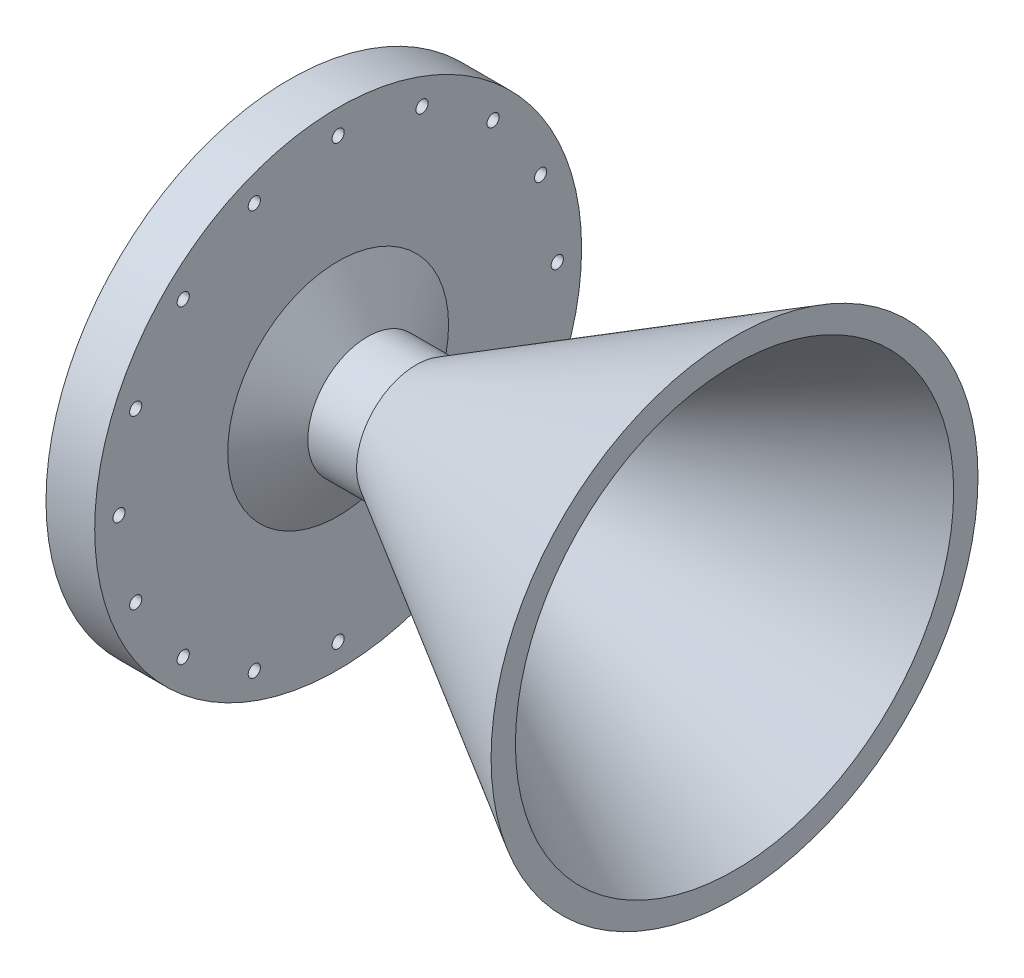
ISO-10303-21;
HEADER;
FILE_DESCRIPTION(('STEP AP214'),'2;1');
FILE_NAME('part.step','',(''),(''),'','','');
FILE_SCHEMA(('AUTOMOTIVE_DESIGN { 1 0 10303 214 1 1 1 1 }'));
ENDSEC;
DATA;
#1=APPLICATION_CONTEXT('core data for automotive mechanical design processes');
#2=APPLICATION_PROTOCOL_DEFINITION('international standard','automotive_design',2000,#1);
#3=PRODUCT_CONTEXT('',#1,'mechanical');
#4=PRODUCT('Part','Part','',(#3));
#5=PRODUCT_RELATED_PRODUCT_CATEGORY('part','',(#4));
#6=PRODUCT_DEFINITION_FORMATION('','',#4);
#7=PRODUCT_DEFINITION_CONTEXT('part definition',#1,'design');
#8=PRODUCT_DEFINITION('design','',#6,#7);
#9=PRODUCT_DEFINITION_SHAPE('','',#8);
#10=(LENGTH_UNIT() NAMED_UNIT(*) SI_UNIT(.MILLI.,.METRE.));
#11=(NAMED_UNIT(*) PLANE_ANGLE_UNIT() SI_UNIT($,.RADIAN.));
#12=(NAMED_UNIT(*) SI_UNIT($,.STERADIAN.) SOLID_ANGLE_UNIT());
#13=UNCERTAINTY_MEASURE_WITH_UNIT(LENGTH_MEASURE(1.E-05),#10,'distance_accuracy_value','');
#14=(GEOMETRIC_REPRESENTATION_CONTEXT(3) GLOBAL_UNCERTAINTY_ASSIGNED_CONTEXT((#13)) GLOBAL_UNIT_ASSIGNED_CONTEXT((#10,
#11,#12)) REPRESENTATION_CONTEXT('',''));
#15=CARTESIAN_POINT('',(0.,0.,0.));
#16=DIRECTION('',(0.,0.,1.));
#17=DIRECTION('',(1.,0.,0.));
#18=AXIS2_PLACEMENT_3D('',#15,#16,#17);
#19=CARTESIAN_POINT('',(-33.0472668619156,50.8,0.));
#20=DIRECTION('',(1.,0.,0.));
#21=DIRECTION('',(0.,0.,-1.));
#22=AXIS2_PLACEMENT_3D('',#19,#20,#21);
#23=PLANE('',#22);
#24=CARTESIAN_POINT('',(-33.0472668619156,0.,0.));
#25=DIRECTION('',(-1.,0.,0.));
#26=DIRECTION('',(0.,0.,1.));
#27=AXIS2_PLACEMENT_3D('',#24,#25,#26);
#28=CIRCLE('',#27,41.275);
#29=CARTESIAN_POINT('',(-33.0472668619156,0.,41.275));
#30=VERTEX_POINT('',#29);
#31=EDGE_CURVE('E54',#30,#30,#28,.T.);
#32=ORIENTED_EDGE('',*,*,#31,.F.);
#33=EDGE_LOOP('',(#32));
#34=FACE_BOUND('',#33,.T.);
#35=CARTESIAN_POINT('',(-33.0472668619156,0.,0.));
#36=DIRECTION('',(-1.,0.,0.));
#37=DIRECTION('',(0.,0.,1.));
#38=AXIS2_PLACEMENT_3D('',#35,#36,#37);
#39=CIRCLE('',#38,47.625);
#40=CARTESIAN_POINT('',(-33.0472668619156,0.,47.625));
#41=VERTEX_POINT('',#40);
#42=EDGE_CURVE('E79',#41,#41,#39,.T.);
#43=ORIENTED_EDGE('',*,*,#42,.T.);
#44=EDGE_LOOP('',(#43));
#45=FACE_BOUND('',#44,.T.);
#46=ADVANCED_FACE('F34',(#34,#45),#23,.F.);
#47=CARTESIAN_POINT('',(0.,0.,0.));
#48=DIRECTION('',(-1.,0.,0.));
#49=DIRECTION('',(0.,0.,1.));
#50=AXIS2_PLACEMENT_3D('',#47,#48,#49);
#51=CYLINDRICAL_SURFACE('',#50,15.5575);
#52=CARTESIAN_POINT('',(-12.7,0.,0.));
#53=DIRECTION('',(-1.,0.,0.));
#54=DIRECTION('',(0.,0.,1.));
#55=AXIS2_PLACEMENT_3D('',#52,#53,#54);
#56=CIRCLE('',#55,15.5575);
#57=CARTESIAN_POINT('',(-12.7,0.,15.5575));
#58=VERTEX_POINT('',#57);
#59=EDGE_CURVE('E10',#58,#58,#56,.T.);
#60=ORIENTED_EDGE('',*,*,#59,.F.);
#61=EDGE_LOOP('',(#60));
#62=FACE_BOUND('',#61,.T.);
#63=CARTESIAN_POINT('',(0.,0.,0.));
#64=DIRECTION('',(-1.,0.,0.));
#65=DIRECTION('',(0.,0.,1.));
#66=AXIS2_PLACEMENT_3D('',#63,#64,#65);
#67=CIRCLE('',#66,15.5575);
#68=CARTESIAN_POINT('',(0.,0.,15.5575));
#69=VERTEX_POINT('',#68);
#70=EDGE_CURVE('E69',#69,#69,#67,.T.);
#71=ORIENTED_EDGE('',*,*,#70,.T.);
#72=EDGE_LOOP('',(#71));
#73=FACE_BOUND('',#72,.T.);
#74=ADVANCED_FACE('F36',(#62,#73),#51,.T.);
#75=CARTESIAN_POINT('',(-12.7,0.,0.));
#76=DIRECTION('',(-1.,0.,0.));
#77=DIRECTION('',(0.,0.,1.));
#78=AXIS2_PLACEMENT_3D('',#75,#76,#77);
#79=CONICAL_SURFACE('',#78,15.5575,1.04719755119659);
#80=CARTESIAN_POINT('',(-20.3472668619156,0.,0.));
#81=DIRECTION('',(-1.,0.,0.));
#82=DIRECTION('',(0.,0.,1.));
#83=AXIS2_PLACEMENT_3D('',#80,#81,#82);
#84=CIRCLE('',#83,28.8029547438755);
#85=CARTESIAN_POINT('',(-20.3472668619156,0.,28.8029547438755));
#86=VERTEX_POINT('',#85);
#87=EDGE_CURVE('E41',#86,#86,#84,.T.);
#88=ORIENTED_EDGE('',*,*,#87,.F.);
#89=EDGE_LOOP('',(#88));
#90=FACE_BOUND('',#89,.T.);
#91=ORIENTED_EDGE('',*,*,#59,.T.);
#92=EDGE_LOOP('',(#91));
#93=FACE_BOUND('',#92,.T.);
#94=ADVANCED_FACE('F187',(#90,#93),#79,.T.);
#95=CARTESIAN_POINT('',(-20.3472668619156,63.5,0.));
#96=DIRECTION('',(-1.,0.,0.));
#97=DIRECTION('',(0.,0.,1.));
#98=AXIS2_PLACEMENT_3D('',#95,#96,#97);
#99=PLANE('',#98);
#100=CARTESIAN_POINT('',(-20.3472668619156,57.15,0.));
#101=DIRECTION('',(-1.,0.,0.));
#102=DIRECTION('',(0.,0.,1.));
#103=AXIS2_PLACEMENT_3D('',#100,#101,#102);
#104=CIRCLE('',#103,1.5875);
#105=CARTESIAN_POINT('',(-20.3472668619156,57.15,1.5875));
#106=VERTEX_POINT('',#105);
#107=EDGE_CURVE('E82',#106,#106,#104,.F.);
#108=ORIENTED_EDGE('',*,*,#107,.F.);
#109=EDGE_LOOP('',(#108));
#110=FACE_BOUND('',#109,.T.);
#111=CARTESIAN_POINT('',(-20.3472668619156,52.79971528302,21.8703581596649));
#112=DIRECTION('',(-1.,0.,0.));
#113=DIRECTION('',(0.,0.,1.));
#114=AXIS2_PLACEMENT_3D('',#111,#112,#113);
#115=CIRCLE('',#114,1.5875);
#116=CARTESIAN_POINT('',(-20.3472668619156,52.79971528302,23.4578581596649));
#117=VERTEX_POINT('',#116);
#118=EDGE_CURVE('E172',#117,#117,#115,.F.);
#119=ORIENTED_EDGE('',*,*,#118,.F.);
#120=EDGE_LOOP('',(#119));
#121=FACE_BOUND('',#120,.T.);
#122=CARTESIAN_POINT('',(-20.3472668619156,40.4111525448111,40.4111525448113));
#123=DIRECTION('',(-1.,0.,0.));
#124=DIRECTION('',(0.,0.,1.));
#125=AXIS2_PLACEMENT_3D('',#122,#123,#124);
#126=CIRCLE('',#125,1.5875);
#127=CARTESIAN_POINT('',(-20.3472668619156,40.4111525448111,41.9986525448113));
#128=VERTEX_POINT('',#127);
#129=EDGE_CURVE('E166',#128,#128,#126,.F.);
#130=ORIENTED_EDGE('',*,*,#129,.F.);
#131=EDGE_LOOP('',(#130));
#132=FACE_BOUND('',#131,.T.);
#133=CARTESIAN_POINT('',(-20.3472668619156,21.8703581596664,52.799715283021));
#134=DIRECTION('',(-1.,0.,0.));
#135=DIRECTION('',(0.,0.,1.));
#136=AXIS2_PLACEMENT_3D('',#133,#134,#135);
#137=CIRCLE('',#136,1.58750000000065);
#138=CARTESIAN_POINT('',(-20.3472668619156,21.8703581596664,54.3872152830217));
#139=VERTEX_POINT('',#138);
#140=EDGE_CURVE('E160',#139,#139,#137,.F.);
#141=ORIENTED_EDGE('',*,*,#140,.F.);
#142=EDGE_LOOP('',(#141));
#143=FACE_BOUND('',#142,.T.);
#144=CARTESIAN_POINT('',(-20.3472668619156,1.61730183749046E-12,57.1500000000016));
#145=DIRECTION('',(-1.,0.,0.));
#146=DIRECTION('',(0.,0.,1.));
#147=AXIS2_PLACEMENT_3D('',#144,#145,#146);
#148=CIRCLE('',#147,1.58750000000126);
#149=CARTESIAN_POINT('',(-20.3472668619156,1.61730183749046E-12,58.7375000000029));
#150=VERTEX_POINT('',#149);
#151=EDGE_CURVE('E154',#150,#150,#148,.F.);
#152=ORIENTED_EDGE('',*,*,#151,.F.);
#153=EDGE_LOOP('',(#152));
#154=FACE_BOUND('',#153,.T.);
#155=CARTESIAN_POINT('',(-20.3472668619156,-21.8703581596634,52.7997152830223));
#156=DIRECTION('',(-1.,0.,0.));
#157=DIRECTION('',(0.,0.,1.));
#158=AXIS2_PLACEMENT_3D('',#155,#156,#157);
#159=CIRCLE('',#158,1.58750000000194);
#160=CARTESIAN_POINT('',(-20.3472668619156,-21.8703581596634,54.3872152830242));
#161=VERTEX_POINT('',#160);
#162=EDGE_CURVE('E148',#161,#161,#159,.F.);
#163=ORIENTED_EDGE('',*,*,#162,.F.);
#164=EDGE_LOOP('',(#163));
#165=FACE_BOUND('',#164,.T.);
#166=CARTESIAN_POINT('',(-20.3472668619156,-40.4111525448101,40.411152544814));
#167=DIRECTION('',(-1.,0.,0.));
#168=DIRECTION('',(0.,0.,1.));
#169=AXIS2_PLACEMENT_3D('',#166,#167,#168);
#170=CIRCLE('',#169,1.58750000000258);
#171=CARTESIAN_POINT('',(-20.3472668619156,-40.4111525448101,41.9986525448165));
#172=VERTEX_POINT('',#171);
#173=EDGE_CURVE('E142',#172,#172,#170,.F.);
#174=ORIENTED_EDGE('',*,*,#173,.F.);
#175=EDGE_LOOP('',(#174));
#176=FACE_BOUND('',#175,.T.);
#177=CARTESIAN_POINT('',(-20.3472668619156,-52.7997152830194,21.870358159668));
#178=DIRECTION('',(-1.,0.,0.));
#179=DIRECTION('',(0.,0.,1.));
#180=AXIS2_PLACEMENT_3D('',#177,#178,#179);
#181=CIRCLE('',#180,1.58750000000313);
#182=CARTESIAN_POINT('',(-20.3472668619156,-52.7997152830194,23.4578581596711));
#183=VERTEX_POINT('',#182);
#184=EDGE_CURVE('E136',#183,#183,#181,.F.);
#185=ORIENTED_EDGE('',*,*,#184,.F.);
#186=EDGE_LOOP('',(#185));
#187=FACE_BOUND('',#186,.T.);
#188=CARTESIAN_POINT('',(-20.3472668619156,-57.15,3.23460367498092E-12));
#189=DIRECTION('',(-1.,0.,0.));
#190=DIRECTION('',(0.,0.,1.));
#191=AXIS2_PLACEMENT_3D('',#188,#189,#190);
#192=CIRCLE('',#191,1.58750000000347);
#193=CARTESIAN_POINT('',(-20.3472668619156,-57.15,1.58750000000671));
#194=VERTEX_POINT('',#193);
#195=EDGE_CURVE('E130',#194,#194,#192,.F.);
#196=ORIENTED_EDGE('',*,*,#195,.F.);
#197=EDGE_LOOP('',(#196));
#198=FACE_BOUND('',#197,.T.);
#199=CARTESIAN_POINT('',(-20.3472668619156,-52.7997152830207,-21.8703581596618));
#200=DIRECTION('',(-1.,0.,0.));
#201=DIRECTION('',(0.,0.,1.));
#202=AXIS2_PLACEMENT_3D('',#199,#200,#201);
#203=CIRCLE('',#202,1.58750000000359);
#204=CARTESIAN_POINT('',(-20.3472668619156,-52.7997152830207,-20.2828581596582));
#205=VERTEX_POINT('',#204);
#206=EDGE_CURVE('E124',#205,#205,#203,.F.);
#207=ORIENTED_EDGE('',*,*,#206,.F.);
#208=EDGE_LOOP('',(#207));
#209=FACE_BOUND('',#208,.T.);
#210=CARTESIAN_POINT('',(-20.3472668619156,-40.4111525448123,-40.4111525448084));
#211=DIRECTION('',(-1.,0.,0.));
#212=DIRECTION('',(0.,0.,1.));
#213=AXIS2_PLACEMENT_3D('',#210,#211,#212);
#214=CIRCLE('',#213,1.58750000000344);
#215=CARTESIAN_POINT('',(-20.3472668619156,-40.4111525448123,-38.823652544805));
#216=VERTEX_POINT('',#215);
#217=EDGE_CURVE('E118',#216,#216,#214,.F.);
#218=ORIENTED_EDGE('',*,*,#217,.F.);
#219=EDGE_LOOP('',(#218));
#220=FACE_BOUND('',#219,.T.);
#221=CARTESIAN_POINT('',(-20.3472668619156,-21.8703581596664,-52.7997152830178));
#222=DIRECTION('',(-1.,0.,0.));
#223=DIRECTION('',(0.,0.,1.));
#224=AXIS2_PLACEMENT_3D('',#221,#222,#223);
#225=CIRCLE('',#224,1.58750000000315);
#226=CARTESIAN_POINT('',(-20.3472668619156,-21.8703581596664,-51.2122152830146));
#227=VERTEX_POINT('',#226);
#228=EDGE_CURVE('E112',#227,#227,#225,.F.);
#229=ORIENTED_EDGE('',*,*,#228,.F.);
#230=EDGE_LOOP('',(#229));
#231=FACE_BOUND('',#230,.T.);
#232=CARTESIAN_POINT('',(-20.3472668619156,-1.62430069394759E-12,-57.1499999999984));
#233=DIRECTION('',(-1.,0.,0.));
#234=DIRECTION('',(0.,0.,1.));
#235=AXIS2_PLACEMENT_3D('',#232,#233,#234);
#236=CIRCLE('',#235,1.5875000000026);
#237=CARTESIAN_POINT('',(-20.3472668619156,-1.62430069394759E-12,-55.5624999999958));
#238=VERTEX_POINT('',#237);
#239=EDGE_CURVE('E106',#238,#238,#236,.F.);
#240=ORIENTED_EDGE('',*,*,#239,.F.);
#241=EDGE_LOOP('',(#240));
#242=FACE_BOUND('',#241,.T.);
#243=CARTESIAN_POINT('',(-20.3472668619156,21.8703581596634,-52.799715283019));
#244=DIRECTION('',(-1.,0.,0.));
#245=DIRECTION('',(0.,0.,1.));
#246=AXIS2_PLACEMENT_3D('',#243,#244,#245);
#247=CIRCLE('',#246,1.58750000000197);
#248=CARTESIAN_POINT('',(-20.3472668619156,21.8703581596634,-51.2122152830171));
#249=VERTEX_POINT('',#248);
#250=EDGE_CURVE('E100',#249,#249,#247,.F.);
#251=ORIENTED_EDGE('',*,*,#250,.F.);
#252=EDGE_LOOP('',(#251));
#253=FACE_BOUND('',#252,.T.);
#254=CARTESIAN_POINT('',(-20.3472668619156,40.41115254481,-40.4111525448107));
#255=DIRECTION('',(-1.,0.,0.));
#256=DIRECTION('',(0.,0.,1.));
#257=AXIS2_PLACEMENT_3D('',#254,#255,#256);
#258=CIRCLE('',#257,1.58750000000145);
#259=CARTESIAN_POINT('',(-20.3472668619156,40.41115254481,-38.8236525448093));
#260=VERTEX_POINT('',#259);
#261=EDGE_CURVE('E94',#260,#260,#258,.F.);
#262=ORIENTED_EDGE('',*,*,#261,.F.);
#263=EDGE_LOOP('',(#262));
#264=FACE_BOUND('',#263,.T.);
#265=CARTESIAN_POINT('',(-20.3472668619156,52.7997152830203,-21.8703581596642));
#266=DIRECTION('',(-1.,0.,0.));
#267=DIRECTION('',(0.,0.,1.));
#268=AXIS2_PLACEMENT_3D('',#265,#266,#267);
#269=CIRCLE('',#268,1.5875);
#270=CARTESIAN_POINT('',(-20.3472668619156,52.7997152830203,-20.2828581596642));
#271=VERTEX_POINT('',#270);
#272=EDGE_CURVE('E88',#271,#271,#269,.F.);
#273=ORIENTED_EDGE('',*,*,#272,.F.);
#274=EDGE_LOOP('',(#273));
#275=FACE_BOUND('',#274,.T.);
#276=CARTESIAN_POINT('',(-20.3472668619156,0.,0.));
#277=DIRECTION('',(-1.,0.,0.));
#278=DIRECTION('',(0.,0.,1.));
#279=AXIS2_PLACEMENT_3D('',#276,#277,#278);
#280=CIRCLE('',#279,63.5);
#281=CARTESIAN_POINT('',(-20.3472668619156,0.,63.5));
#282=VERTEX_POINT('',#281);
#283=EDGE_CURVE('E45',#282,#282,#280,.T.);
#284=ORIENTED_EDGE('',*,*,#283,.F.);
#285=EDGE_LOOP('',(#284));
#286=FACE_BOUND('',#285,.T.);
#287=ORIENTED_EDGE('',*,*,#87,.T.);
#288=EDGE_LOOP('',(#287));
#289=FACE_BOUND('',#288,.T.);
#290=ADVANCED_FACE('F183',(#110,#121,#132,#143,#154,#165,#176,#187,#198,#209,#220,#231,#242,
#253,#264,#275,#286,#289),#99,.F.);
#291=CARTESIAN_POINT('',(0.,0.,0.));
#292=DIRECTION('',(-1.,0.,0.));
#293=DIRECTION('',(0.,0.,1.));
#294=AXIS2_PLACEMENT_3D('',#291,#292,#293);
#295=CYLINDRICAL_SURFACE('',#294,63.5);
#296=CARTESIAN_POINT('',(-33.0472668619156,0.,0.));
#297=DIRECTION('',(-1.,0.,0.));
#298=DIRECTION('',(0.,0.,1.));
#299=AXIS2_PLACEMENT_3D('',#296,#297,#298);
#300=CIRCLE('',#299,63.5);
#301=CARTESIAN_POINT('',(-33.0472668619156,0.,63.5));
#302=VERTEX_POINT('',#301);
#303=EDGE_CURVE('E49',#302,#302,#300,.T.);
#304=ORIENTED_EDGE('',*,*,#303,.F.);
#305=EDGE_LOOP('',(#304));
#306=FACE_BOUND('',#305,.T.);
#307=ORIENTED_EDGE('',*,*,#283,.T.);
#308=EDGE_LOOP('',(#307));
#309=FACE_BOUND('',#308,.T.);
#310=ADVANCED_FACE('F186',(#306,#309),#295,.T.);
#311=CARTESIAN_POINT('',(-33.0472668619156,57.15,0.));
#312=DIRECTION('',(-1.,0.,0.));
#313=DIRECTION('',(0.,0.,1.));
#314=AXIS2_PLACEMENT_3D('',#311,#312,#313);
#315=CIRCLE('',#314,1.5875);
#316=CARTESIAN_POINT('',(-33.0472668619156,57.15,1.5875));
#317=VERTEX_POINT('',#316);
#318=EDGE_CURVE('E175',#317,#317,#315,.T.);
#319=ORIENTED_EDGE('',*,*,#318,.F.);
#320=EDGE_LOOP('',(#319));
#321=FACE_BOUND('',#320,.T.);
#322=CARTESIAN_POINT('',(-33.0472668619156,52.79971528302,21.8703581596649));
#323=DIRECTION('',(-1.,0.,0.));
#324=DIRECTION('',(0.,0.,1.));
#325=AXIS2_PLACEMENT_3D('',#322,#323,#324);
#326=CIRCLE('',#325,1.5875);
#327=CARTESIAN_POINT('',(-33.0472668619156,52.79971528302,23.4578581596649));
#328=VERTEX_POINT('',#327);
#329=EDGE_CURVE('E169',#328,#328,#326,.T.);
#330=ORIENTED_EDGE('',*,*,#329,.F.);
#331=EDGE_LOOP('',(#330));
#332=FACE_BOUND('',#331,.T.);
#333=CARTESIAN_POINT('',(-33.0472668619156,40.4111525448111,40.4111525448113));
#334=DIRECTION('',(-1.,0.,0.));
#335=DIRECTION('',(0.,0.,1.));
#336=AXIS2_PLACEMENT_3D('',#333,#334,#335);
#337=CIRCLE('',#336,1.5875);
#338=CARTESIAN_POINT('',(-33.0472668619156,40.4111525448111,41.9986525448113));
#339=VERTEX_POINT('',#338);
#340=EDGE_CURVE('E163',#339,#339,#337,.T.);
#341=ORIENTED_EDGE('',*,*,#340,.F.);
#342=EDGE_LOOP('',(#341));
#343=FACE_BOUND('',#342,.T.);
#344=CARTESIAN_POINT('',(-33.0472668619156,21.8703581596664,52.799715283021));
#345=DIRECTION('',(-1.,0.,0.));
#346=DIRECTION('',(0.,0.,1.));
#347=AXIS2_PLACEMENT_3D('',#344,#345,#346);
#348=CIRCLE('',#347,1.58750000000065);
#349=CARTESIAN_POINT('',(-33.0472668619156,21.8703581596664,54.3872152830217));
#350=VERTEX_POINT('',#349);
#351=EDGE_CURVE('E157',#350,#350,#348,.T.);
#352=ORIENTED_EDGE('',*,*,#351,.F.);
#353=EDGE_LOOP('',(#352));
#354=FACE_BOUND('',#353,.T.);
#355=CARTESIAN_POINT('',(-33.0472668619156,1.61730183749046E-12,57.1500000000016));
#356=DIRECTION('',(-1.,0.,0.));
#357=DIRECTION('',(0.,0.,1.));
#358=AXIS2_PLACEMENT_3D('',#355,#356,#357);
#359=CIRCLE('',#358,1.58750000000126);
#360=CARTESIAN_POINT('',(-33.0472668619156,1.61730183749046E-12,58.7375000000029));
#361=VERTEX_POINT('',#360);
#362=EDGE_CURVE('E151',#361,#361,#359,.T.);
#363=ORIENTED_EDGE('',*,*,#362,.F.);
#364=EDGE_LOOP('',(#363));
#365=FACE_BOUND('',#364,.T.);
#366=CARTESIAN_POINT('',(-33.0472668619156,-21.8703581596634,52.7997152830223));
#367=DIRECTION('',(-1.,0.,0.));
#368=DIRECTION('',(0.,0.,1.));
#369=AXIS2_PLACEMENT_3D('',#366,#367,#368);
#370=CIRCLE('',#369,1.58750000000194);
#371=CARTESIAN_POINT('',(-33.0472668619156,-21.8703581596634,54.3872152830242));
#372=VERTEX_POINT('',#371);
#373=EDGE_CURVE('E145',#372,#372,#370,.T.);
#374=ORIENTED_EDGE('',*,*,#373,.F.);
#375=EDGE_LOOP('',(#374));
#376=FACE_BOUND('',#375,.T.);
#377=CARTESIAN_POINT('',(-33.0472668619156,-40.4111525448101,40.411152544814));
#378=DIRECTION('',(-1.,0.,0.));
#379=DIRECTION('',(0.,0.,1.));
#380=AXIS2_PLACEMENT_3D('',#377,#378,#379);
#381=CIRCLE('',#380,1.58750000000258);
#382=CARTESIAN_POINT('',(-33.0472668619156,-40.4111525448101,41.9986525448165));
#383=VERTEX_POINT('',#382);
#384=EDGE_CURVE('E139',#383,#383,#381,.T.);
#385=ORIENTED_EDGE('',*,*,#384,.F.);
#386=EDGE_LOOP('',(#385));
#387=FACE_BOUND('',#386,.T.);
#388=CARTESIAN_POINT('',(-33.0472668619156,-52.7997152830194,21.870358159668));
#389=DIRECTION('',(-1.,0.,0.));
#390=DIRECTION('',(0.,0.,1.));
#391=AXIS2_PLACEMENT_3D('',#388,#389,#390);
#392=CIRCLE('',#391,1.58750000000313);
#393=CARTESIAN_POINT('',(-33.0472668619156,-52.7997152830194,23.4578581596711));
#394=VERTEX_POINT('',#393);
#395=EDGE_CURVE('E133',#394,#394,#392,.T.);
#396=ORIENTED_EDGE('',*,*,#395,.F.);
#397=EDGE_LOOP('',(#396));
#398=FACE_BOUND('',#397,.T.);
#399=CARTESIAN_POINT('',(-33.0472668619156,-57.15,3.23460367498092E-12));
#400=DIRECTION('',(-1.,0.,0.));
#401=DIRECTION('',(0.,0.,1.));
#402=AXIS2_PLACEMENT_3D('',#399,#400,#401);
#403=CIRCLE('',#402,1.58750000000347);
#404=CARTESIAN_POINT('',(-33.0472668619156,-57.15,1.58750000000671));
#405=VERTEX_POINT('',#404);
#406=EDGE_CURVE('E127',#405,#405,#403,.T.);
#407=ORIENTED_EDGE('',*,*,#406,.F.);
#408=EDGE_LOOP('',(#407));
#409=FACE_BOUND('',#408,.T.);
#410=CARTESIAN_POINT('',(-33.0472668619156,-52.7997152830207,-21.8703581596618));
#411=DIRECTION('',(-1.,0.,0.));
#412=DIRECTION('',(0.,0.,1.));
#413=AXIS2_PLACEMENT_3D('',#410,#411,#412);
#414=CIRCLE('',#413,1.58750000000359);
#415=CARTESIAN_POINT('',(-33.0472668619156,-52.7997152830207,-20.2828581596582));
#416=VERTEX_POINT('',#415);
#417=EDGE_CURVE('E121',#416,#416,#414,.T.);
#418=ORIENTED_EDGE('',*,*,#417,.F.);
#419=EDGE_LOOP('',(#418));
#420=FACE_BOUND('',#419,.T.);
#421=CARTESIAN_POINT('',(-33.0472668619156,-40.4111525448123,-40.4111525448084));
#422=DIRECTION('',(-1.,0.,0.));
#423=DIRECTION('',(0.,0.,1.));
#424=AXIS2_PLACEMENT_3D('',#421,#422,#423);
#425=CIRCLE('',#424,1.58750000000344);
#426=CARTESIAN_POINT('',(-33.0472668619156,-40.4111525448123,-38.823652544805));
#427=VERTEX_POINT('',#426);
#428=EDGE_CURVE('E115',#427,#427,#425,.T.);
#429=ORIENTED_EDGE('',*,*,#428,.F.);
#430=EDGE_LOOP('',(#429));
#431=FACE_BOUND('',#430,.T.);
#432=CARTESIAN_POINT('',(-33.0472668619156,-21.8703581596664,-52.7997152830178));
#433=DIRECTION('',(-1.,0.,0.));
#434=DIRECTION('',(0.,0.,1.));
#435=AXIS2_PLACEMENT_3D('',#432,#433,#434);
#436=CIRCLE('',#435,1.58750000000315);
#437=CARTESIAN_POINT('',(-33.0472668619156,-21.8703581596664,-51.2122152830146));
#438=VERTEX_POINT('',#437);
#439=EDGE_CURVE('E109',#438,#438,#436,.T.);
#440=ORIENTED_EDGE('',*,*,#439,.F.);
#441=EDGE_LOOP('',(#440));
#442=FACE_BOUND('',#441,.T.);
#443=CARTESIAN_POINT('',(-33.0472668619156,-1.62430069394759E-12,-57.1499999999984));
#444=DIRECTION('',(-1.,0.,0.));
#445=DIRECTION('',(0.,0.,1.));
#446=AXIS2_PLACEMENT_3D('',#443,#444,#445);
#447=CIRCLE('',#446,1.5875000000026);
#448=CARTESIAN_POINT('',(-33.0472668619156,-1.62430069394759E-12,-55.5624999999958));
#449=VERTEX_POINT('',#448);
#450=EDGE_CURVE('E103',#449,#449,#447,.T.);
#451=ORIENTED_EDGE('',*,*,#450,.F.);
#452=EDGE_LOOP('',(#451));
#453=FACE_BOUND('',#452,.T.);
#454=CARTESIAN_POINT('',(-33.0472668619156,21.8703581596634,-52.799715283019));
#455=DIRECTION('',(-1.,0.,0.));
#456=DIRECTION('',(0.,0.,1.));
#457=AXIS2_PLACEMENT_3D('',#454,#455,#456);
#458=CIRCLE('',#457,1.58750000000197);
#459=CARTESIAN_POINT('',(-33.0472668619156,21.8703581596634,-51.2122152830171));
#460=VERTEX_POINT('',#459);
#461=EDGE_CURVE('E97',#460,#460,#458,.T.);
#462=ORIENTED_EDGE('',*,*,#461,.F.);
#463=EDGE_LOOP('',(#462));
#464=FACE_BOUND('',#463,.T.);
#465=CARTESIAN_POINT('',(-33.0472668619156,40.41115254481,-40.4111525448107));
#466=DIRECTION('',(-1.,0.,0.));
#467=DIRECTION('',(0.,0.,1.));
#468=AXIS2_PLACEMENT_3D('',#465,#466,#467);
#469=CIRCLE('',#468,1.58750000000145);
#470=CARTESIAN_POINT('',(-33.0472668619156,40.41115254481,-38.8236525448093));
#471=VERTEX_POINT('',#470);
#472=EDGE_CURVE('E91',#471,#471,#469,.T.);
#473=ORIENTED_EDGE('',*,*,#472,.F.);
#474=EDGE_LOOP('',(#473));
#475=FACE_BOUND('',#474,.T.);
#476=CARTESIAN_POINT('',(-33.0472668619156,52.7997152830203,-21.8703581596642));
#477=DIRECTION('',(-1.,0.,0.));
#478=DIRECTION('',(0.,0.,1.));
#479=AXIS2_PLACEMENT_3D('',#476,#477,#478);
#480=CIRCLE('',#479,1.5875);
#481=CARTESIAN_POINT('',(-33.0472668619156,52.7997152830203,-20.2828581596642));
#482=VERTEX_POINT('',#481);
#483=EDGE_CURVE('E85',#482,#482,#480,.T.);
#484=ORIENTED_EDGE('',*,*,#483,.F.);
#485=EDGE_LOOP('',(#484));
#486=FACE_BOUND('',#485,.T.);
#487=CARTESIAN_POINT('',(-33.0472668619156,0.,0.));
#488=DIRECTION('',(-1.,0.,0.));
#489=DIRECTION('',(0.,0.,1.));
#490=AXIS2_PLACEMENT_3D('',#487,#488,#489);
#491=CIRCLE('',#490,50.00625);
#492=CARTESIAN_POINT('',(-33.0472668619156,0.,50.00625));
#493=VERTEX_POINT('',#492);
#494=EDGE_CURVE('E73',#493,#493,#491,.T.);
#495=ORIENTED_EDGE('',*,*,#494,.F.);
#496=EDGE_LOOP('',(#495));
#497=FACE_BOUND('',#496,.T.);
#498=ORIENTED_EDGE('',*,*,#303,.T.);
#499=EDGE_LOOP('',(#498));
#500=FACE_BOUND('',#499,.T.);
#501=ADVANCED_FACE('F222',(#321,#332,#343,#354,#365,#376,#387,#398,#409,#420,#431,#442,#453,
#464,#475,#486,#497,#500),#23,.F.);
#502=CARTESIAN_POINT('',(-33.0472668619156,0.,0.));
#503=DIRECTION('',(-1.,0.,0.));
#504=DIRECTION('',(0.,0.,1.));
#505=AXIS2_PLACEMENT_3D('',#502,#503,#504);
#506=CONICAL_SURFACE('',#505,41.275,1.02280730700641);
#507=CARTESIAN_POINT('',(-12.7,0.,0.));
#508=DIRECTION('',(-1.,0.,0.));
#509=DIRECTION('',(0.,0.,1.));
#510=AXIS2_PLACEMENT_3D('',#507,#508,#509);
#511=CIRCLE('',#510,7.9375);
#512=CARTESIAN_POINT('',(-12.7,0.,7.9375));
#513=VERTEX_POINT('',#512);
#514=EDGE_CURVE('E57',#513,#513,#511,.T.);
#515=ORIENTED_EDGE('',*,*,#514,.F.);
#516=EDGE_LOOP('',(#515));
#517=FACE_BOUND('',#516,.T.);
#518=ORIENTED_EDGE('',*,*,#31,.T.);
#519=EDGE_LOOP('',(#518));
#520=FACE_BOUND('',#519,.T.);
#521=ADVANCED_FACE('F228',(#517,#520),#506,.F.);
#522=CARTESIAN_POINT('',(0.,0.,0.));
#523=DIRECTION('',(-1.,0.,0.));
#524=DIRECTION('',(0.,0.,1.));
#525=AXIS2_PLACEMENT_3D('',#522,#523,#524);
#526=CYLINDRICAL_SURFACE('',#525,7.9375);
#527=CARTESIAN_POINT('',(0.,0.,0.));
#528=DIRECTION('',(-1.,0.,0.));
#529=DIRECTION('',(0.,0.,1.));
#530=AXIS2_PLACEMENT_3D('',#527,#528,#529);
#531=CIRCLE('',#530,7.9375);
#532=CARTESIAN_POINT('',(0.,0.,7.9375));
#533=VERTEX_POINT('',#532);
#534=EDGE_CURVE('E60',#533,#533,#531,.T.);
#535=ORIENTED_EDGE('',*,*,#534,.F.);
#536=EDGE_LOOP('',(#535));
#537=FACE_BOUND('',#536,.T.);
#538=ORIENTED_EDGE('',*,*,#514,.T.);
#539=EDGE_LOOP('',(#538));
#540=FACE_BOUND('',#539,.T.);
#541=ADVANCED_FACE('F243',(#537,#540),#526,.F.);
#542=CARTESIAN_POINT('',(0.,0.,0.));
#543=DIRECTION('',(1.,0.,0.));
#544=DIRECTION('',(0.,0.,-1.));
#545=AXIS2_PLACEMENT_3D('',#542,#543,#544);
#546=CONICAL_SURFACE('',#545,7.9375,0.534993353531431);
#547=CARTESIAN_POINT('',(83.0388458418706,0.,0.));
#548=DIRECTION('',(-1.,0.,0.));
#549=DIRECTION('',(0.,0.,1.));
#550=AXIS2_PLACEMENT_3D('',#547,#548,#549);
#551=CIRCLE('',#550,57.15);
#552=CARTESIAN_POINT('',(83.0388458418706,0.,57.15));
#553=VERTEX_POINT('',#552);
#554=EDGE_CURVE('E63',#553,#553,#551,.T.);
#555=ORIENTED_EDGE('',*,*,#554,.F.);
#556=EDGE_LOOP('',(#555));
#557=FACE_BOUND('',#556,.T.);
#558=ORIENTED_EDGE('',*,*,#534,.T.);
#559=EDGE_LOOP('',(#558));
#560=FACE_BOUND('',#559,.T.);
#561=ADVANCED_FACE('F247',(#557,#560),#546,.F.);
#562=CARTESIAN_POINT('',(83.0388458418706,63.5,0.));
#563=DIRECTION('',(-1.,0.,0.));
#564=DIRECTION('',(0.,0.,1.));
#565=AXIS2_PLACEMENT_3D('',#562,#563,#564);
#566=PLANE('',#565);
#567=CARTESIAN_POINT('',(83.0388458418706,0.,0.));
#568=DIRECTION('',(-1.,0.,0.));
#569=DIRECTION('',(0.,0.,1.));
#570=AXIS2_PLACEMENT_3D('',#567,#568,#569);
#571=CIRCLE('',#570,63.5);
#572=CARTESIAN_POINT('',(83.0388458418706,0.,63.5));
#573=VERTEX_POINT('',#572);
#574=EDGE_CURVE('E66',#573,#573,#571,.T.);
#575=ORIENTED_EDGE('',*,*,#574,.F.);
#576=EDGE_LOOP('',(#575));
#577=FACE_BOUND('',#576,.T.);
#578=ORIENTED_EDGE('',*,*,#554,.T.);
#579=EDGE_LOOP('',(#578));
#580=FACE_BOUND('',#579,.T.);
#581=ADVANCED_FACE('F251',(#577,#580),#566,.F.);
#582=CARTESIAN_POINT('',(83.0388458418706,0.,0.));
#583=DIRECTION('',(1.,0.,0.));
#584=DIRECTION('',(0.,0.,-1.));
#585=AXIS2_PLACEMENT_3D('',#582,#583,#584);
#586=CONICAL_SURFACE('',#585,63.5,0.5235987755983);
#587=ORIENTED_EDGE('',*,*,#70,.F.);
#588=EDGE_LOOP('',(#587));
#589=FACE_BOUND('',#588,.T.);
#590=ORIENTED_EDGE('',*,*,#574,.T.);
#591=EDGE_LOOP('',(#590));
#592=FACE_BOUND('',#591,.T.);
#593=ADVANCED_FACE('F255',(#589,#592),#586,.T.);
#594=CARTESIAN_POINT('',(-31.8566418619156,0.,0.));
#595=DIRECTION('',(-1.,0.,0.));
#596=DIRECTION('',(0.,0.,1.));
#597=AXIS2_PLACEMENT_3D('',#594,#595,#596);
#598=CYLINDRICAL_SURFACE('',#597,50.00625);
#599=CARTESIAN_POINT('',(-31.8566418619156,0.,0.));
#600=DIRECTION('',(-1.,0.,0.));
#601=DIRECTION('',(0.,0.,1.));
#602=AXIS2_PLACEMENT_3D('',#599,#600,#601);
#603=CIRCLE('',#602,50.00625);
#604=CARTESIAN_POINT('',(-31.8566418619156,0.,50.00625));
#605=VERTEX_POINT('',#604);
#606=EDGE_CURVE('E72',#605,#605,#603,.T.);
#607=ORIENTED_EDGE('',*,*,#606,.F.);
#608=EDGE_LOOP('',(#607));
#609=FACE_BOUND('',#608,.T.);
#610=ORIENTED_EDGE('',*,*,#494,.T.);
#611=EDGE_LOOP('',(#610));
#612=FACE_BOUND('',#611,.T.);
#613=ADVANCED_FACE('F259',(#609,#612),#598,.F.);
#614=CARTESIAN_POINT('',(-31.8566418619156,0.,0.));
#615=DIRECTION('',(-1.,0.,0.));
#616=DIRECTION('',(0.,0.,1.));
#617=AXIS2_PLACEMENT_3D('',#614,#615,#616);
#618=PLANE('',#617);
#619=CARTESIAN_POINT('',(-31.8566418619156,0.,0.));
#620=DIRECTION('',(-1.,0.,0.));
#621=DIRECTION('',(0.,0.,1.));
#622=AXIS2_PLACEMENT_3D('',#619,#620,#621);
#623=CIRCLE('',#622,47.625);
#624=CARTESIAN_POINT('',(-31.8566418619156,0.,47.625));
#625=VERTEX_POINT('',#624);
#626=EDGE_CURVE('E76',#625,#625,#623,.T.);
#627=ORIENTED_EDGE('',*,*,#626,.F.);
#628=EDGE_LOOP('',(#627));
#629=FACE_BOUND('',#628,.T.);
#630=ORIENTED_EDGE('',*,*,#606,.T.);
#631=EDGE_LOOP('',(#630));
#632=FACE_BOUND('',#631,.T.);
#633=ADVANCED_FACE('F263',(#629,#632),#618,.T.);
#634=CARTESIAN_POINT('',(-31.8566418619156,0.,0.));
#635=DIRECTION('',(-1.,0.,0.));
#636=DIRECTION('',(0.,0.,1.));
#637=AXIS2_PLACEMENT_3D('',#634,#635,#636);
#638=CYLINDRICAL_SURFACE('',#637,47.625);
#639=ORIENTED_EDGE('',*,*,#626,.T.);
#640=EDGE_LOOP('',(#639));
#641=FACE_BOUND('',#640,.T.);
#642=ORIENTED_EDGE('',*,*,#42,.F.);
#643=EDGE_LOOP('',(#642));
#644=FACE_BOUND('',#643,.T.);
#645=ADVANCED_FACE('F267',(#641,#644),#638,.T.);
#646=CARTESIAN_POINT('',(83.0398458418706,52.7997152830203,-21.8703581596642));
#647=DIRECTION('',(-1.,0.,0.));
#648=DIRECTION('',(0.,0.,1.));
#649=AXIS2_PLACEMENT_3D('',#646,#647,#648);
#650=CYLINDRICAL_SURFACE('',#649,1.5875);
#651=ORIENTED_EDGE('',*,*,#483,.T.);
#652=EDGE_LOOP('',(#651));
#653=FACE_BOUND('',#652,.T.);
#654=ORIENTED_EDGE('',*,*,#272,.T.);
#655=EDGE_LOOP('',(#654));
#656=FACE_BOUND('',#655,.T.);
#657=ADVANCED_FACE('F271',(#653,#656),#650,.F.);
#658=CARTESIAN_POINT('',(83.0398458418706,40.41115254481,-40.4111525448107));
#659=DIRECTION('',(-1.,0.,0.));
#660=DIRECTION('',(0.,0.,1.));
#661=AXIS2_PLACEMENT_3D('',#658,#659,#660);
#662=CYLINDRICAL_SURFACE('',#661,1.58750000000145);
#663=ORIENTED_EDGE('',*,*,#472,.T.);
#664=EDGE_LOOP('',(#663));
#665=FACE_BOUND('',#664,.T.);
#666=ORIENTED_EDGE('',*,*,#261,.T.);
#667=EDGE_LOOP('',(#666));
#668=FACE_BOUND('',#667,.T.);
#669=ADVANCED_FACE('F275',(#665,#668),#662,.F.);
#670=CARTESIAN_POINT('',(83.0398458418706,21.8703581596634,-52.799715283019));
#671=DIRECTION('',(-1.,0.,0.));
#672=DIRECTION('',(0.,0.,1.));
#673=AXIS2_PLACEMENT_3D('',#670,#671,#672);
#674=CYLINDRICAL_SURFACE('',#673,1.58750000000197);
#675=ORIENTED_EDGE('',*,*,#461,.T.);
#676=EDGE_LOOP('',(#675));
#677=FACE_BOUND('',#676,.T.);
#678=ORIENTED_EDGE('',*,*,#250,.T.);
#679=EDGE_LOOP('',(#678));
#680=FACE_BOUND('',#679,.T.);
#681=ADVANCED_FACE('F279',(#677,#680),#674,.F.);
#682=CARTESIAN_POINT('',(83.0398458418706,-1.62430069394759E-12,-57.1499999999984));
#683=DIRECTION('',(-1.,0.,0.));
#684=DIRECTION('',(0.,0.,1.));
#685=AXIS2_PLACEMENT_3D('',#682,#683,#684);
#686=CYLINDRICAL_SURFACE('',#685,1.5875000000026);
#687=ORIENTED_EDGE('',*,*,#450,.T.);
#688=EDGE_LOOP('',(#687));
#689=FACE_BOUND('',#688,.T.);
#690=ORIENTED_EDGE('',*,*,#239,.T.);
#691=EDGE_LOOP('',(#690));
#692=FACE_BOUND('',#691,.T.);
#693=ADVANCED_FACE('F283',(#689,#692),#686,.F.);
#694=CARTESIAN_POINT('',(83.0398458418706,-21.8703581596664,-52.7997152830178));
#695=DIRECTION('',(-1.,0.,0.));
#696=DIRECTION('',(0.,0.,1.));
#697=AXIS2_PLACEMENT_3D('',#694,#695,#696);
#698=CYLINDRICAL_SURFACE('',#697,1.58750000000315);
#699=ORIENTED_EDGE('',*,*,#439,.T.);
#700=EDGE_LOOP('',(#699));
#701=FACE_BOUND('',#700,.T.);
#702=ORIENTED_EDGE('',*,*,#228,.T.);
#703=EDGE_LOOP('',(#702));
#704=FACE_BOUND('',#703,.T.);
#705=ADVANCED_FACE('F287',(#701,#704),#698,.F.);
#706=CARTESIAN_POINT('',(83.0398458418706,-40.4111525448123,-40.4111525448084));
#707=DIRECTION('',(-1.,0.,0.));
#708=DIRECTION('',(0.,0.,1.));
#709=AXIS2_PLACEMENT_3D('',#706,#707,#708);
#710=CYLINDRICAL_SURFACE('',#709,1.58750000000344);
#711=ORIENTED_EDGE('',*,*,#428,.T.);
#712=EDGE_LOOP('',(#711));
#713=FACE_BOUND('',#712,.T.);
#714=ORIENTED_EDGE('',*,*,#217,.T.);
#715=EDGE_LOOP('',(#714));
#716=FACE_BOUND('',#715,.T.);
#717=ADVANCED_FACE('F291',(#713,#716),#710,.F.);
#718=CARTESIAN_POINT('',(83.0398458418706,-52.7997152830207,-21.8703581596618));
#719=DIRECTION('',(-1.,0.,0.));
#720=DIRECTION('',(0.,0.,1.));
#721=AXIS2_PLACEMENT_3D('',#718,#719,#720);
#722=CYLINDRICAL_SURFACE('',#721,1.58750000000359);
#723=ORIENTED_EDGE('',*,*,#417,.T.);
#724=EDGE_LOOP('',(#723));
#725=FACE_BOUND('',#724,.T.);
#726=ORIENTED_EDGE('',*,*,#206,.T.);
#727=EDGE_LOOP('',(#726));
#728=FACE_BOUND('',#727,.T.);
#729=ADVANCED_FACE('F295',(#725,#728),#722,.F.);
#730=CARTESIAN_POINT('',(83.0398458418706,-57.15,3.23460367498092E-12));
#731=DIRECTION('',(-1.,0.,0.));
#732=DIRECTION('',(0.,0.,1.));
#733=AXIS2_PLACEMENT_3D('',#730,#731,#732);
#734=CYLINDRICAL_SURFACE('',#733,1.58750000000347);
#735=ORIENTED_EDGE('',*,*,#406,.T.);
#736=EDGE_LOOP('',(#735));
#737=FACE_BOUND('',#736,.T.);
#738=ORIENTED_EDGE('',*,*,#195,.T.);
#739=EDGE_LOOP('',(#738));
#740=FACE_BOUND('',#739,.T.);
#741=ADVANCED_FACE('F299',(#737,#740),#734,.F.);
#742=CARTESIAN_POINT('',(83.0398458418706,-52.7997152830194,21.870358159668));
#743=DIRECTION('',(-1.,0.,0.));
#744=DIRECTION('',(0.,0.,1.));
#745=AXIS2_PLACEMENT_3D('',#742,#743,#744);
#746=CYLINDRICAL_SURFACE('',#745,1.58750000000313);
#747=ORIENTED_EDGE('',*,*,#395,.T.);
#748=EDGE_LOOP('',(#747));
#749=FACE_BOUND('',#748,.T.);
#750=ORIENTED_EDGE('',*,*,#184,.T.);
#751=EDGE_LOOP('',(#750));
#752=FACE_BOUND('',#751,.T.);
#753=ADVANCED_FACE('F303',(#749,#752),#746,.F.);
#754=CARTESIAN_POINT('',(83.0398458418706,-40.4111525448101,40.411152544814));
#755=DIRECTION('',(-1.,0.,0.));
#756=DIRECTION('',(0.,0.,1.));
#757=AXIS2_PLACEMENT_3D('',#754,#755,#756);
#758=CYLINDRICAL_SURFACE('',#757,1.58750000000258);
#759=ORIENTED_EDGE('',*,*,#384,.T.);
#760=EDGE_LOOP('',(#759));
#761=FACE_BOUND('',#760,.T.);
#762=ORIENTED_EDGE('',*,*,#173,.T.);
#763=EDGE_LOOP('',(#762));
#764=FACE_BOUND('',#763,.T.);
#765=ADVANCED_FACE('F307',(#761,#764),#758,.F.);
#766=CARTESIAN_POINT('',(83.0398458418706,-21.8703581596634,52.7997152830223));
#767=DIRECTION('',(-1.,0.,0.));
#768=DIRECTION('',(0.,0.,1.));
#769=AXIS2_PLACEMENT_3D('',#766,#767,#768);
#770=CYLINDRICAL_SURFACE('',#769,1.58750000000194);
#771=ORIENTED_EDGE('',*,*,#373,.T.);
#772=EDGE_LOOP('',(#771));
#773=FACE_BOUND('',#772,.T.);
#774=ORIENTED_EDGE('',*,*,#162,.T.);
#775=EDGE_LOOP('',(#774));
#776=FACE_BOUND('',#775,.T.);
#777=ADVANCED_FACE('F311',(#773,#776),#770,.F.);
#778=CARTESIAN_POINT('',(83.0398458418706,1.61730183749046E-12,57.1500000000016));
#779=DIRECTION('',(-1.,0.,0.));
#780=DIRECTION('',(0.,0.,1.));
#781=AXIS2_PLACEMENT_3D('',#778,#779,#780);
#782=CYLINDRICAL_SURFACE('',#781,1.58750000000126);
#783=ORIENTED_EDGE('',*,*,#362,.T.);
#784=EDGE_LOOP('',(#783));
#785=FACE_BOUND('',#784,.T.);
#786=ORIENTED_EDGE('',*,*,#151,.T.);
#787=EDGE_LOOP('',(#786));
#788=FACE_BOUND('',#787,.T.);
#789=ADVANCED_FACE('F315',(#785,#788),#782,.F.);
#790=CARTESIAN_POINT('',(83.0398458418706,21.8703581596664,52.799715283021));
#791=DIRECTION('',(-1.,0.,0.));
#792=DIRECTION('',(0.,0.,1.));
#793=AXIS2_PLACEMENT_3D('',#790,#791,#792);
#794=CYLINDRICAL_SURFACE('',#793,1.58750000000065);
#795=ORIENTED_EDGE('',*,*,#351,.T.);
#796=EDGE_LOOP('',(#795));
#797=FACE_BOUND('',#796,.T.);
#798=ORIENTED_EDGE('',*,*,#140,.T.);
#799=EDGE_LOOP('',(#798));
#800=FACE_BOUND('',#799,.T.);
#801=ADVANCED_FACE('F319',(#797,#800),#794,.F.);
#802=CARTESIAN_POINT('',(83.0398458418706,40.4111525448111,40.4111525448113));
#803=DIRECTION('',(-1.,0.,0.));
#804=DIRECTION('',(0.,0.,1.));
#805=AXIS2_PLACEMENT_3D('',#802,#803,#804);
#806=CYLINDRICAL_SURFACE('',#805,1.5875);
#807=ORIENTED_EDGE('',*,*,#340,.T.);
#808=EDGE_LOOP('',(#807));
#809=FACE_BOUND('',#808,.T.);
#810=ORIENTED_EDGE('',*,*,#129,.T.);
#811=EDGE_LOOP('',(#810));
#812=FACE_BOUND('',#811,.T.);
#813=ADVANCED_FACE('F323',(#809,#812),#806,.F.);
#814=CARTESIAN_POINT('',(83.0398458418706,52.79971528302,21.8703581596649));
#815=DIRECTION('',(-1.,0.,0.));
#816=DIRECTION('',(0.,0.,1.));
#817=AXIS2_PLACEMENT_3D('',#814,#815,#816);
#818=CYLINDRICAL_SURFACE('',#817,1.5875);
#819=ORIENTED_EDGE('',*,*,#329,.T.);
#820=EDGE_LOOP('',(#819));
#821=FACE_BOUND('',#820,.T.);
#822=ORIENTED_EDGE('',*,*,#118,.T.);
#823=EDGE_LOOP('',(#822));
#824=FACE_BOUND('',#823,.T.);
#825=ADVANCED_FACE('F327',(#821,#824),#818,.F.);
#826=CARTESIAN_POINT('',(83.0398458418706,57.15,0.));
#827=DIRECTION('',(-1.,0.,0.));
#828=DIRECTION('',(0.,0.,1.));
#829=AXIS2_PLACEMENT_3D('',#826,#827,#828);
#830=CYLINDRICAL_SURFACE('',#829,1.5875);
#831=ORIENTED_EDGE('',*,*,#318,.T.);
#832=EDGE_LOOP('',(#831));
#833=FACE_BOUND('',#832,.T.);
#834=ORIENTED_EDGE('',*,*,#107,.T.);
#835=EDGE_LOOP('',(#834));
#836=FACE_BOUND('',#835,.T.);
#837=ADVANCED_FACE('F181',(#833,#836),#830,.F.);
#838=CLOSED_SHELL('',(#46,#74,#94,#290,#310,#501,#521,#541,#561,#581,#593,#613,#633,#645,#657,
#669,#681,#693,#705,#717,#729,#741,#753,#765,#777,#789,#801,#813,#825,#837));
#839=MANIFOLD_SOLID_BREP('B2',#838);
#840=ADVANCED_BREP_SHAPE_REPRESENTATION('',(#18,#839),#14);
#841=SHAPE_DEFINITION_REPRESENTATION(#9,#840);
ENDSEC;
END-ISO-10303-21;
